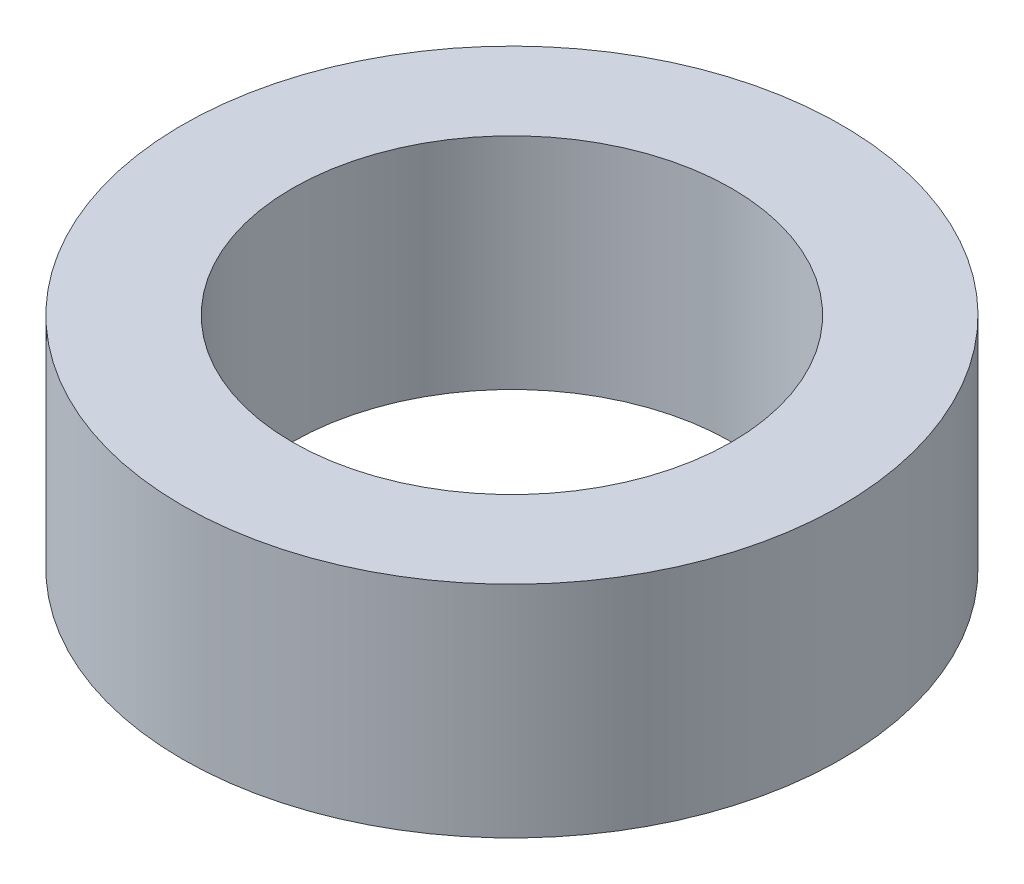
ISO-10303-21;
HEADER;
FILE_DESCRIPTION(('STEP AP214'),'2;1');
FILE_NAME('part.step','',(''),(''),'','','');
FILE_SCHEMA(('AUTOMOTIVE_DESIGN { 1 0 10303 214 1 1 1 1 }'));
ENDSEC;
DATA;
#1=APPLICATION_CONTEXT('core data for automotive mechanical design processes');
#2=APPLICATION_PROTOCOL_DEFINITION('international standard','automotive_design',2000,#1);
#3=PRODUCT_CONTEXT('',#1,'mechanical');
#4=PRODUCT('Part','Part','',(#3));
#5=PRODUCT_RELATED_PRODUCT_CATEGORY('part','',(#4));
#6=PRODUCT_DEFINITION_FORMATION('','',#4);
#7=PRODUCT_DEFINITION_CONTEXT('part definition',#1,'design');
#8=PRODUCT_DEFINITION('design','',#6,#7);
#9=PRODUCT_DEFINITION_SHAPE('','',#8);
#10=(LENGTH_UNIT() NAMED_UNIT(*) SI_UNIT(.MILLI.,.METRE.));
#11=(NAMED_UNIT(*) PLANE_ANGLE_UNIT() SI_UNIT($,.RADIAN.));
#12=(NAMED_UNIT(*) SI_UNIT($,.STERADIAN.) SOLID_ANGLE_UNIT());
#13=UNCERTAINTY_MEASURE_WITH_UNIT(LENGTH_MEASURE(1.E-05),#10,'distance_accuracy_value','');
#14=(GEOMETRIC_REPRESENTATION_CONTEXT(3) GLOBAL_UNCERTAINTY_ASSIGNED_CONTEXT((#13)) GLOBAL_UNIT_ASSIGNED_CONTEXT((#10,
#11,#12)) REPRESENTATION_CONTEXT('',''));
#15=CARTESIAN_POINT('',(0.,0.,0.));
#16=DIRECTION('',(0.,0.,1.));
#17=DIRECTION('',(1.,0.,0.));
#18=AXIS2_PLACEMENT_3D('',#15,#16,#17);
#19=CARTESIAN_POINT('',(0.,12.7,0.));
#20=DIRECTION('',(0.,1.,0.));
#21=DIRECTION('',(0.,0.,1.));
#22=AXIS2_PLACEMENT_3D('',#19,#20,#21);
#23=PLANE('',#22);
#24=CARTESIAN_POINT('',(0.,12.7,0.));
#25=DIRECTION('',(0.,1.,0.));
#26=DIRECTION('',(0.,0.,1.));
#27=AXIS2_PLACEMENT_3D('',#24,#25,#26);
#28=CIRCLE('',#27,19.05);
#29=CARTESIAN_POINT('',(0.,12.7,19.05));
#30=VERTEX_POINT('',#29);
#31=EDGE_CURVE('E10',#30,#30,#28,.T.);
#32=ORIENTED_EDGE('',*,*,#31,.T.);
#33=EDGE_LOOP('',(#32));
#34=FACE_BOUND('',#33,.T.);
#35=CARTESIAN_POINT('',(0.,12.7,0.));
#36=DIRECTION('',(0.,1.,0.));
#37=DIRECTION('',(0.,0.,1.));
#38=AXIS2_PLACEMENT_3D('',#35,#36,#37);
#39=CIRCLE('',#38,12.7);
#40=CARTESIAN_POINT('',(0.,12.7,12.7));
#41=VERTEX_POINT('',#40);
#42=EDGE_CURVE('E42',#41,#41,#39,.T.);
#43=ORIENTED_EDGE('',*,*,#42,.F.);
#44=EDGE_LOOP('',(#43));
#45=FACE_BOUND('',#44,.T.);
#46=ADVANCED_FACE('F31',(#34,#45),#23,.T.);
#47=CARTESIAN_POINT('',(0.,0.,0.));
#48=DIRECTION('',(0.,1.,0.));
#49=DIRECTION('',(0.,0.,1.));
#50=AXIS2_PLACEMENT_3D('',#47,#48,#49);
#51=PLANE('',#50);
#52=CARTESIAN_POINT('',(0.,0.,0.));
#53=DIRECTION('',(0.,1.,0.));
#54=DIRECTION('',(0.,0.,1.));
#55=AXIS2_PLACEMENT_3D('',#52,#53,#54);
#56=CIRCLE('',#55,19.05);
#57=CARTESIAN_POINT('',(0.,0.,19.05));
#58=VERTEX_POINT('',#57);
#59=EDGE_CURVE('E35',#58,#58,#56,.T.);
#60=ORIENTED_EDGE('',*,*,#59,.F.);
#61=EDGE_LOOP('',(#60));
#62=FACE_BOUND('',#61,.T.);
#63=CARTESIAN_POINT('',(0.,0.,0.));
#64=DIRECTION('',(0.,1.,0.));
#65=DIRECTION('',(0.,0.,1.));
#66=AXIS2_PLACEMENT_3D('',#63,#64,#65);
#67=CIRCLE('',#66,12.7);
#68=CARTESIAN_POINT('',(0.,0.,12.7));
#69=VERTEX_POINT('',#68);
#70=EDGE_CURVE('E44',#69,#69,#67,.T.);
#71=ORIENTED_EDGE('',*,*,#70,.T.);
#72=EDGE_LOOP('',(#71));
#73=FACE_BOUND('',#72,.T.);
#74=ADVANCED_FACE('F54',(#62,#73),#51,.F.);
#75=CARTESIAN_POINT('',(0.,12.7,0.));
#76=DIRECTION('',(0.,-1.,0.));
#77=DIRECTION('',(0.,0.,-1.));
#78=AXIS2_PLACEMENT_3D('',#75,#76,#77);
#79=CYLINDRICAL_SURFACE('',#78,19.05);
#80=ORIENTED_EDGE('',*,*,#31,.F.);
#81=EDGE_LOOP('',(#80));
#82=FACE_BOUND('',#81,.T.);
#83=ORIENTED_EDGE('',*,*,#59,.T.);
#84=EDGE_LOOP('',(#83));
#85=FACE_BOUND('',#84,.T.);
#86=ADVANCED_FACE('F33',(#82,#85),#79,.T.);
#87=CARTESIAN_POINT('',(0.,12.7,0.));
#88=DIRECTION('',(0.,-1.,0.));
#89=DIRECTION('',(0.,0.,-1.));
#90=AXIS2_PLACEMENT_3D('',#87,#88,#89);
#91=CYLINDRICAL_SURFACE('',#90,12.7);
#92=ORIENTED_EDGE('',*,*,#42,.T.);
#93=EDGE_LOOP('',(#92));
#94=FACE_BOUND('',#93,.T.);
#95=ORIENTED_EDGE('',*,*,#70,.F.);
#96=EDGE_LOOP('',(#95));
#97=FACE_BOUND('',#96,.T.);
#98=ADVANCED_FACE('F50',(#94,#97),#91,.F.);
#99=CLOSED_SHELL('',(#46,#74,#86,#98));
#100=MANIFOLD_SOLID_BREP('B2',#99);
#101=ADVANCED_BREP_SHAPE_REPRESENTATION('',(#18,#100),#14);
#102=SHAPE_DEFINITION_REPRESENTATION(#9,#101);
ENDSEC;
END-ISO-10303-21;
